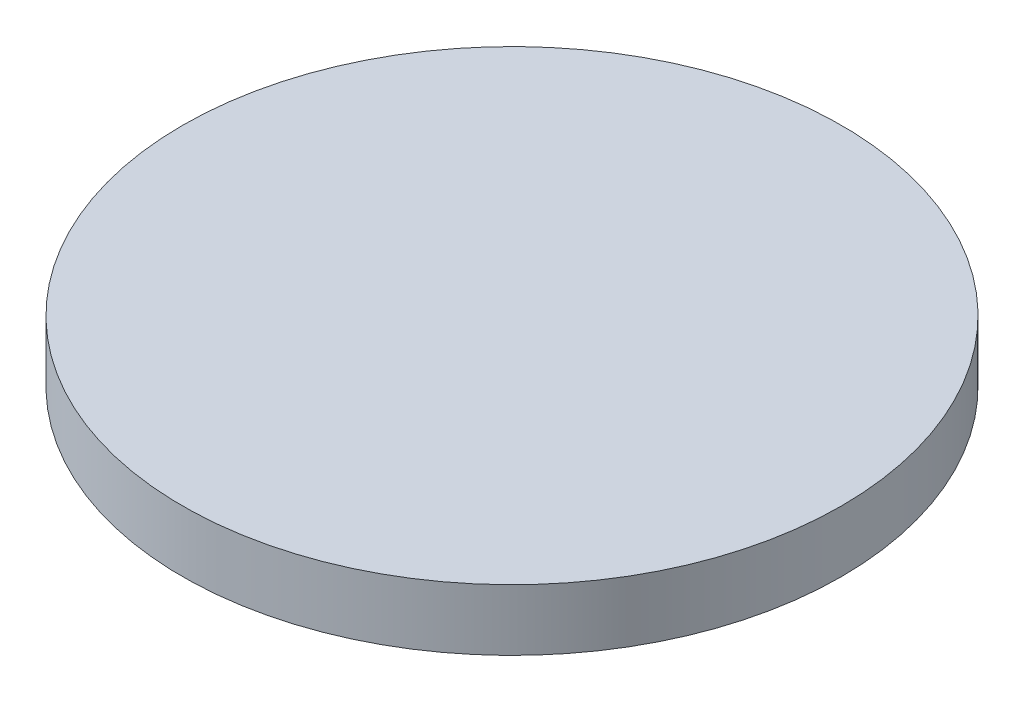
ISO-10303-21;
HEADER;
FILE_DESCRIPTION(('STEP AP214'),'2;1');
FILE_NAME('part.step','',(''),(''),'','','');
FILE_SCHEMA(('AUTOMOTIVE_DESIGN { 1 0 10303 214 1 1 1 1 }'));
ENDSEC;
DATA;
#1=APPLICATION_CONTEXT('core data for automotive mechanical design processes');
#2=APPLICATION_PROTOCOL_DEFINITION('international standard','automotive_design',2000,#1);
#3=PRODUCT_CONTEXT('',#1,'mechanical');
#4=PRODUCT('Part','Part','',(#3));
#5=PRODUCT_RELATED_PRODUCT_CATEGORY('part','',(#4));
#6=PRODUCT_DEFINITION_FORMATION('','',#4);
#7=PRODUCT_DEFINITION_CONTEXT('part definition',#1,'design');
#8=PRODUCT_DEFINITION('design','',#6,#7);
#9=PRODUCT_DEFINITION_SHAPE('','',#8);
#10=(LENGTH_UNIT() NAMED_UNIT(*) SI_UNIT(.MILLI.,.METRE.));
#11=(NAMED_UNIT(*) PLANE_ANGLE_UNIT() SI_UNIT($,.RADIAN.));
#12=(NAMED_UNIT(*) SI_UNIT($,.STERADIAN.) SOLID_ANGLE_UNIT());
#13=UNCERTAINTY_MEASURE_WITH_UNIT(LENGTH_MEASURE(1.E-05),#10,'distance_accuracy_value','');
#14=(GEOMETRIC_REPRESENTATION_CONTEXT(3) GLOBAL_UNCERTAINTY_ASSIGNED_CONTEXT((#13)) GLOBAL_UNIT_ASSIGNED_CONTEXT((#10,
#11,#12)) REPRESENTATION_CONTEXT('',''));
#15=CARTESIAN_POINT('',(0.,0.,0.));
#16=DIRECTION('',(0.,0.,1.));
#17=DIRECTION('',(1.,0.,0.));
#18=AXIS2_PLACEMENT_3D('',#15,#16,#17);
#19=CARTESIAN_POINT('',(0.,-6.34999999999998,0.));
#20=DIRECTION('',(0.,1.,0.));
#21=DIRECTION('',(-1.,0.,0.));
#22=AXIS2_PLACEMENT_3D('',#19,#20,#21);
#23=PLANE('',#22);
#24=CARTESIAN_POINT('',(0.,-6.34999999999997,0.));
#25=DIRECTION('',(0.,1.,0.));
#26=DIRECTION('',(-1.,0.,0.));
#27=AXIS2_PLACEMENT_3D('',#24,#25,#26);
#28=CIRCLE('',#27,34.1630000000001);
#29=CARTESIAN_POINT('',(-34.1630000000002,-6.34999999999997,0.));
#30=VERTEX_POINT('',#29);
#31=EDGE_CURVE('E10',#30,#30,#28,.T.);
#32=ORIENTED_EDGE('',*,*,#31,.F.);
#33=EDGE_LOOP('',(#32));
#34=FACE_BOUND('',#33,.T.);
#35=ADVANCED_FACE('F30',(#34),#23,.F.);
#36=CARTESIAN_POINT('',(0.,-815.847874149681,0.));
#37=DIRECTION('',(0.,1.,0.));
#38=DIRECTION('',(-1.,0.,0.));
#39=AXIS2_PLACEMENT_3D('',#36,#37,#38);
#40=CYLINDRICAL_SURFACE('',#39,34.1630000000001);
#41=CARTESIAN_POINT('',(0.,0.,0.));
#42=DIRECTION('',(0.,1.,0.));
#43=DIRECTION('',(-1.,0.,0.));
#44=AXIS2_PLACEMENT_3D('',#41,#42,#43);
#45=CIRCLE('',#44,34.1630000000001);
#46=CARTESIAN_POINT('',(-34.1630000000002,0.,0.));
#47=VERTEX_POINT('',#46);
#48=EDGE_CURVE('E36',#47,#47,#45,.T.);
#49=ORIENTED_EDGE('',*,*,#48,.F.);
#50=EDGE_LOOP('',(#49));
#51=FACE_BOUND('',#50,.T.);
#52=ORIENTED_EDGE('',*,*,#31,.T.);
#53=EDGE_LOOP('',(#52));
#54=FACE_BOUND('',#53,.T.);
#55=ADVANCED_FACE('F44',(#51,#54),#40,.T.);
#56=CARTESIAN_POINT('',(0.,0.,0.));
#57=DIRECTION('',(0.,-1.,0.));
#58=DIRECTION('',(1.,0.,0.));
#59=AXIS2_PLACEMENT_3D('',#56,#57,#58);
#60=PLANE('',#59);
#61=ORIENTED_EDGE('',*,*,#48,.T.);
#62=EDGE_LOOP('',(#61));
#63=FACE_BOUND('',#62,.T.);
#64=ADVANCED_FACE('F42',(#63),#60,.F.);
#65=CLOSED_SHELL('',(#35,#55,#64));
#66=MANIFOLD_SOLID_BREP('B2',#65);
#67=ADVANCED_BREP_SHAPE_REPRESENTATION('',(#18,#66),#14);
#68=SHAPE_DEFINITION_REPRESENTATION(#9,#67);
ENDSEC;
END-ISO-10303-21;
